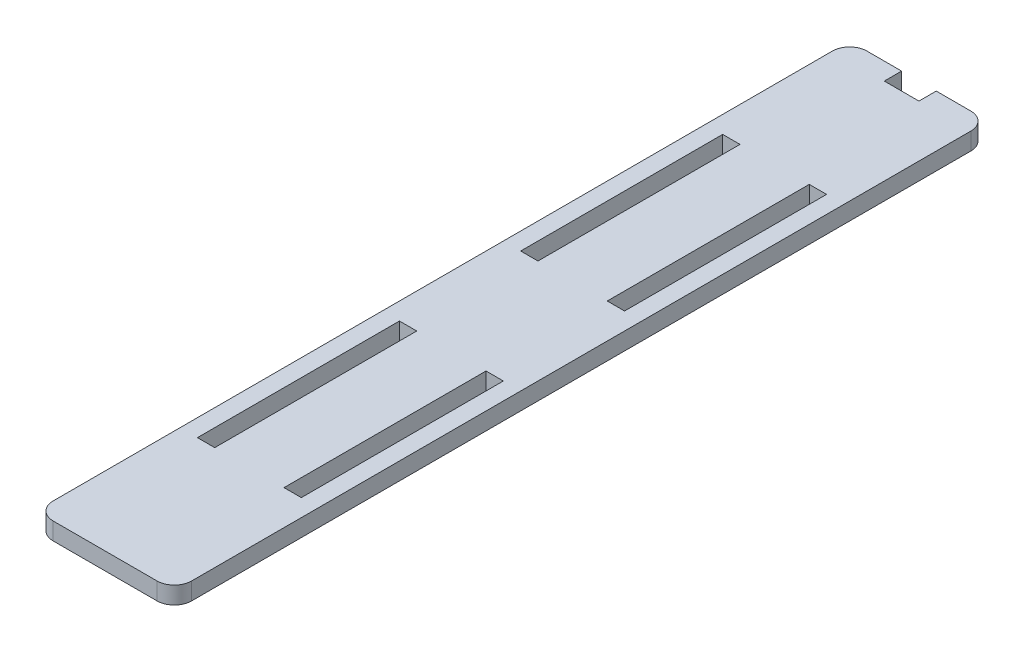
ISO-10303-21;
HEADER;
FILE_DESCRIPTION(('STEP AP214'),'2;1');
FILE_NAME('part.step','',(''),(''),'','','');
FILE_SCHEMA(('AUTOMOTIVE_DESIGN { 1 0 10303 214 1 1 1 1 }'));
ENDSEC;
DATA;
#1=APPLICATION_CONTEXT('core data for automotive mechanical design processes');
#2=APPLICATION_PROTOCOL_DEFINITION('international standard','automotive_design',2000,#1);
#3=PRODUCT_CONTEXT('',#1,'mechanical');
#4=PRODUCT('Part','Part','',(#3));
#5=PRODUCT_RELATED_PRODUCT_CATEGORY('part','',(#4));
#6=PRODUCT_DEFINITION_FORMATION('','',#4);
#7=PRODUCT_DEFINITION_CONTEXT('part definition',#1,'design');
#8=PRODUCT_DEFINITION('design','',#6,#7);
#9=PRODUCT_DEFINITION_SHAPE('','',#8);
#10=(LENGTH_UNIT() NAMED_UNIT(*) SI_UNIT(.MILLI.,.METRE.));
#11=(NAMED_UNIT(*) PLANE_ANGLE_UNIT() SI_UNIT($,.RADIAN.));
#12=(NAMED_UNIT(*) SI_UNIT($,.STERADIAN.) SOLID_ANGLE_UNIT());
#13=UNCERTAINTY_MEASURE_WITH_UNIT(LENGTH_MEASURE(1.E-05),#10,'distance_accuracy_value','');
#14=(GEOMETRIC_REPRESENTATION_CONTEXT(3) GLOBAL_UNCERTAINTY_ASSIGNED_CONTEXT((#13)) GLOBAL_UNIT_ASSIGNED_CONTEXT((#10,
#11,#12)) REPRESENTATION_CONTEXT('',''));
#15=CARTESIAN_POINT('',(0.,0.,0.));
#16=DIRECTION('',(0.,0.,1.));
#17=DIRECTION('',(1.,0.,0.));
#18=AXIS2_PLACEMENT_3D('',#15,#16,#17);
#19=CARTESIAN_POINT('',(-12.,1.5,-70.5));
#20=DIRECTION('',(0.,0.,1.));
#21=DIRECTION('',(1.,0.,0.));
#22=AXIS2_PLACEMENT_3D('',#19,#20,#21);
#23=PLANE('',#22);
#24=DIRECTION('',(-1.,0.,0.));
#25=VECTOR('',#24,1.);
#26=CARTESIAN_POINT('',(-12.,1.5,-70.5));
#27=LINE('',#26,#25);
#28=CARTESIAN_POINT('',(-3.,1.5,-70.5));
#29=VERTEX_POINT('',#28);
#30=CARTESIAN_POINT('',(-9.,1.5,-70.5));
#31=VERTEX_POINT('',#30);
#32=EDGE_CURVE('E58',#29,#31,#27,.T.);
#33=ORIENTED_EDGE('',*,*,#32,.F.);
#34=DIRECTION('',(0.,1.,0.));
#35=VECTOR('',#34,1.);
#36=CARTESIAN_POINT('',(-3.,-1.5,-70.5));
#37=LINE('',#36,#35);
#38=CARTESIAN_POINT('',(-3.,-1.5,-70.5));
#39=VERTEX_POINT('',#38);
#40=EDGE_CURVE('E236',#39,#29,#37,.T.);
#41=ORIENTED_EDGE('',*,*,#40,.F.);
#42=DIRECTION('',(-1.,0.,0.));
#43=VECTOR('',#42,1.);
#44=CARTESIAN_POINT('',(-12.,-1.5,-70.5));
#45=LINE('',#44,#43);
#46=CARTESIAN_POINT('',(-9.,-1.5,-70.5));
#47=VERTEX_POINT('',#46);
#48=EDGE_CURVE('E404',#39,#47,#45,.T.);
#49=ORIENTED_EDGE('',*,*,#48,.T.);
#50=DIRECTION('',(0.,-1.,0.));
#51=VECTOR('',#50,1.);
#52=CARTESIAN_POINT('',(-9.,1.5,-70.5));
#53=LINE('',#52,#51);
#54=EDGE_CURVE('E43',#47,#31,#53,.F.);
#55=ORIENTED_EDGE('',*,*,#54,.T.);
#56=EDGE_LOOP('',(#33,#41,#49,#55));
#57=FACE_BOUND('',#56,.T.);
#58=ADVANCED_FACE('F35',(#57),#23,.F.);
#59=CARTESIAN_POINT('',(-12.,1.5,-70.5));
#60=DIRECTION('',(1.,0.,0.));
#61=DIRECTION('',(0.,0.,-1.));
#62=AXIS2_PLACEMENT_3D('',#59,#60,#61);
#63=PLANE('',#62);
#64=DIRECTION('',(0.,0.,1.));
#65=VECTOR('',#64,1.);
#66=CARTESIAN_POINT('',(-12.,-1.5,-70.5));
#67=LINE('',#66,#65);
#68=CARTESIAN_POINT('',(-12.,-1.5,-67.5));
#69=VERTEX_POINT('',#68);
#70=CARTESIAN_POINT('',(-12.,-1.5,67.5));
#71=VERTEX_POINT('',#70);
#72=EDGE_CURVE('E376',#69,#71,#67,.T.);
#73=ORIENTED_EDGE('',*,*,#72,.T.);
#74=DIRECTION('',(0.,-1.,0.));
#75=VECTOR('',#74,1.);
#76=CARTESIAN_POINT('',(-12.,1.5,67.5));
#77=LINE('',#76,#75);
#78=CARTESIAN_POINT('',(-12.,1.5,67.5));
#79=VERTEX_POINT('',#78);
#80=EDGE_CURVE('E436',#71,#79,#77,.F.);
#81=ORIENTED_EDGE('',*,*,#80,.T.);
#82=DIRECTION('',(0.,0.,1.));
#83=VECTOR('',#82,1.);
#84=CARTESIAN_POINT('',(-12.,1.5,-70.5));
#85=LINE('',#84,#83);
#86=CARTESIAN_POINT('',(-12.,1.5,-67.5));
#87=VERTEX_POINT('',#86);
#88=EDGE_CURVE('E383',#87,#79,#85,.T.);
#89=ORIENTED_EDGE('',*,*,#88,.F.);
#90=DIRECTION('',(0.,-1.,0.));
#91=VECTOR('',#90,1.);
#92=CARTESIAN_POINT('',(-12.,1.5,-67.5));
#93=LINE('',#92,#91);
#94=EDGE_CURVE('E433',#87,#69,#93,.T.);
#95=ORIENTED_EDGE('',*,*,#94,.T.);
#96=EDGE_LOOP('',(#73,#81,#89,#95));
#97=FACE_BOUND('',#96,.T.);
#98=ADVANCED_FACE('F446',(#97),#63,.F.);
#99=CARTESIAN_POINT('',(-12.,1.5,70.5));
#100=DIRECTION('',(0.,0.,-1.));
#101=DIRECTION('',(-1.,0.,0.));
#102=AXIS2_PLACEMENT_3D('',#99,#100,#101);
#103=PLANE('',#102);
#104=DIRECTION('',(1.,0.,0.));
#105=VECTOR('',#104,1.);
#106=CARTESIAN_POINT('',(-12.,-1.5,70.5));
#107=LINE('',#106,#105);
#108=CARTESIAN_POINT('',(-8.99999999999999,-1.5,70.5));
#109=VERTEX_POINT('',#108);
#110=CARTESIAN_POINT('',(9.,-1.5,70.5));
#111=VERTEX_POINT('',#110);
#112=EDGE_CURVE('E398',#109,#111,#107,.T.);
#113=ORIENTED_EDGE('',*,*,#112,.T.);
#114=DIRECTION('',(0.,-1.,0.));
#115=VECTOR('',#114,1.);
#116=CARTESIAN_POINT('',(9.,1.5,70.5));
#117=LINE('',#116,#115);
#118=CARTESIAN_POINT('',(9.,1.5,70.5));
#119=VERTEX_POINT('',#118);
#120=EDGE_CURVE('E423',#111,#119,#117,.F.);
#121=ORIENTED_EDGE('',*,*,#120,.T.);
#122=DIRECTION('',(1.,0.,0.));
#123=VECTOR('',#122,1.);
#124=CARTESIAN_POINT('',(-12.,1.5,70.5));
#125=LINE('',#124,#123);
#126=CARTESIAN_POINT('',(-8.99999999999999,1.5,70.5));
#127=VERTEX_POINT('',#126);
#128=EDGE_CURVE('E386',#127,#119,#125,.T.);
#129=ORIENTED_EDGE('',*,*,#128,.F.);
#130=DIRECTION('',(0.,-1.,0.));
#131=VECTOR('',#130,1.);
#132=CARTESIAN_POINT('',(-8.99999999999999,1.5,70.5));
#133=LINE('',#132,#131);
#134=EDGE_CURVE('E420',#127,#109,#133,.T.);
#135=ORIENTED_EDGE('',*,*,#134,.T.);
#136=EDGE_LOOP('',(#113,#121,#129,#135));
#137=FACE_BOUND('',#136,.T.);
#138=ADVANCED_FACE('F455',(#137),#103,.F.);
#139=CARTESIAN_POINT('',(12.,1.5,-70.5));
#140=DIRECTION('',(-1.,0.,0.));
#141=DIRECTION('',(0.,0.,1.));
#142=AXIS2_PLACEMENT_3D('',#139,#140,#141);
#143=PLANE('',#142);
#144=DIRECTION('',(0.,0.,-1.));
#145=VECTOR('',#144,1.);
#146=CARTESIAN_POINT('',(12.,1.5,-70.5));
#147=LINE('',#146,#145);
#148=CARTESIAN_POINT('',(12.,1.5,67.5));
#149=VERTEX_POINT('',#148);
#150=CARTESIAN_POINT('',(12.,1.5,-67.5));
#151=VERTEX_POINT('',#150);
#152=EDGE_CURVE('E390',#149,#151,#147,.T.);
#153=ORIENTED_EDGE('',*,*,#152,.F.);
#154=DIRECTION('',(0.,-1.,0.));
#155=VECTOR('',#154,1.);
#156=CARTESIAN_POINT('',(12.,1.5,67.5));
#157=LINE('',#156,#155);
#158=CARTESIAN_POINT('',(12.,-1.5,67.5));
#159=VERTEX_POINT('',#158);
#160=EDGE_CURVE('E408',#149,#159,#157,.T.);
#161=ORIENTED_EDGE('',*,*,#160,.T.);
#162=DIRECTION('',(0.,0.,-1.));
#163=VECTOR('',#162,1.);
#164=CARTESIAN_POINT('',(12.,-1.5,-70.5));
#165=LINE('',#164,#163);
#166=CARTESIAN_POINT('',(12.,-1.5,-67.5));
#167=VERTEX_POINT('',#166);
#168=EDGE_CURVE('E401',#159,#167,#165,.T.);
#169=ORIENTED_EDGE('',*,*,#168,.T.);
#170=DIRECTION('',(0.,-1.,0.));
#171=VECTOR('',#170,1.);
#172=CARTESIAN_POINT('',(12.,1.5,-67.5));
#173=LINE('',#172,#171);
#174=EDGE_CURVE('E395',#167,#151,#173,.F.);
#175=ORIENTED_EDGE('',*,*,#174,.T.);
#176=EDGE_LOOP('',(#153,#161,#169,#175));
#177=FACE_BOUND('',#176,.T.);
#178=ADVANCED_FACE('F464',(#177),#143,.F.);
#179=CARTESIAN_POINT('',(9.00000000000001,-1.5,-70.5));
#180=VERTEX_POINT('',#179);
#181=CARTESIAN_POINT('',(3.,-1.5,-70.5));
#182=VERTEX_POINT('',#181);
#183=EDGE_CURVE('E387',#180,#182,#45,.T.);
#184=ORIENTED_EDGE('',*,*,#183,.T.);
#185=DIRECTION('',(0.,1.,0.));
#186=VECTOR('',#185,1.);
#187=CARTESIAN_POINT('',(3.,-1.5,-70.5));
#188=LINE('',#187,#186);
#189=CARTESIAN_POINT('',(3.,1.5,-70.5));
#190=VERTEX_POINT('',#189);
#191=EDGE_CURVE('E251',#182,#190,#188,.T.);
#192=ORIENTED_EDGE('',*,*,#191,.T.);
#193=CARTESIAN_POINT('',(9.00000000000001,1.5,-70.5));
#194=VERTEX_POINT('',#193);
#195=EDGE_CURVE('E393',#194,#190,#27,.T.);
#196=ORIENTED_EDGE('',*,*,#195,.F.);
#197=DIRECTION('',(0.,-1.,0.));
#198=VECTOR('',#197,1.);
#199=CARTESIAN_POINT('',(9.00000000000001,1.5,-70.5));
#200=LINE('',#199,#198);
#201=EDGE_CURVE('E11',#194,#180,#200,.T.);
#202=ORIENTED_EDGE('',*,*,#201,.T.);
#203=EDGE_LOOP('',(#184,#192,#196,#202));
#204=FACE_BOUND('',#203,.T.);
#205=ADVANCED_FACE('F472',(#204),#23,.F.);
#206=CARTESIAN_POINT('',(0.,1.5,0.));
#207=DIRECTION('',(0.,1.,0.));
#208=DIRECTION('',(0.,0.,1.));
#209=AXIS2_PLACEMENT_3D('',#206,#207,#208);
#210=PLANE('',#209);
#211=DIRECTION('',(0.,0.,1.));
#212=VECTOR('',#211,1.);
#213=CARTESIAN_POINT('',(-3.,1.5,-70.5));
#214=LINE('',#213,#212);
#215=CARTESIAN_POINT('',(-3.,1.5,-67.5));
#216=VERTEX_POINT('',#215);
#217=EDGE_CURVE('E233',#29,#216,#214,.T.);
#218=ORIENTED_EDGE('',*,*,#217,.F.);
#219=ORIENTED_EDGE('',*,*,#32,.T.);
#220=CARTESIAN_POINT('',(-9.,1.5,-67.5));
#221=DIRECTION('',(0.,1.,0.));
#222=DIRECTION('',(0.,0.,1.));
#223=AXIS2_PLACEMENT_3D('',#220,#221,#222);
#224=CIRCLE('',#223,3.);
#225=EDGE_CURVE('E425',#31,#87,#224,.T.);
#226=ORIENTED_EDGE('',*,*,#225,.T.);
#227=ORIENTED_EDGE('',*,*,#88,.T.);
#228=CARTESIAN_POINT('',(-8.99999999999999,1.5,67.5));
#229=DIRECTION('',(0.,1.,0.));
#230=DIRECTION('',(0.,0.,1.));
#231=AXIS2_PLACEMENT_3D('',#228,#229,#230);
#232=CIRCLE('',#231,3.);
#233=EDGE_CURVE('E429',#79,#127,#232,.T.);
#234=ORIENTED_EDGE('',*,*,#233,.T.);
#235=ORIENTED_EDGE('',*,*,#128,.T.);
#236=CARTESIAN_POINT('',(9.00000000000001,1.5,67.5));
#237=DIRECTION('',(0.,1.,0.));
#238=DIRECTION('',(0.,0.,1.));
#239=AXIS2_PLACEMENT_3D('',#236,#237,#238);
#240=CIRCLE('',#239,3.);
#241=EDGE_CURVE('E431',#119,#149,#240,.T.);
#242=ORIENTED_EDGE('',*,*,#241,.T.);
#243=ORIENTED_EDGE('',*,*,#152,.T.);
#244=CARTESIAN_POINT('',(9.00000000000001,1.5,-67.5));
#245=DIRECTION('',(0.,1.,0.));
#246=DIRECTION('',(0.,0.,1.));
#247=AXIS2_PLACEMENT_3D('',#244,#245,#246);
#248=CIRCLE('',#247,3.);
#249=EDGE_CURVE('E427',#151,#194,#248,.T.);
#250=ORIENTED_EDGE('',*,*,#249,.T.);
#251=ORIENTED_EDGE('',*,*,#195,.T.);
#252=DIRECTION('',(0.,0.,-1.));
#253=VECTOR('',#252,1.);
#254=CARTESIAN_POINT('',(3.,1.5,-70.5));
#255=LINE('',#254,#253);
#256=CARTESIAN_POINT('',(3.,1.5,-67.5));
#257=VERTEX_POINT('',#256);
#258=EDGE_CURVE('E241',#257,#190,#255,.T.);
#259=ORIENTED_EDGE('',*,*,#258,.F.);
#260=DIRECTION('',(1.,0.,0.));
#261=VECTOR('',#260,1.);
#262=CARTESIAN_POINT('',(-3.,1.5,-67.5));
#263=LINE('',#262,#261);
#264=EDGE_CURVE('E225',#216,#257,#263,.T.);
#265=ORIENTED_EDGE('',*,*,#264,.F.);
#266=EDGE_LOOP('',(#218,#219,#226,#227,#234,#235,#242,#243,#250,#251,#259,#265));
#267=FACE_BOUND('',#266,.T.);
#268=DIRECTION('',(-1.,0.,0.));
#269=VECTOR('',#268,1.);
#270=CARTESIAN_POINT('',(9.,1.5,-45.5));
#271=LINE('',#270,#269);
#272=CARTESIAN_POINT('',(9.,1.5,-45.5));
#273=VERTEX_POINT('',#272);
#274=CARTESIAN_POINT('',(6.,1.5,-45.5));
#275=VERTEX_POINT('',#274);
#276=EDGE_CURVE('E287',#273,#275,#271,.T.);
#277=ORIENTED_EDGE('',*,*,#276,.F.);
#278=DIRECTION('',(0.,0.,-1.));
#279=VECTOR('',#278,1.);
#280=CARTESIAN_POINT('',(9.,1.5,-45.5));
#281=LINE('',#280,#279);
#282=CARTESIAN_POINT('',(9.,1.5,-10.5));
#283=VERTEX_POINT('',#282);
#284=EDGE_CURVE('E296',#283,#273,#281,.T.);
#285=ORIENTED_EDGE('',*,*,#284,.F.);
#286=DIRECTION('',(1.,0.,0.));
#287=VECTOR('',#286,1.);
#288=CARTESIAN_POINT('',(9.,1.5,-10.5));
#289=LINE('',#288,#287);
#290=CARTESIAN_POINT('',(5.99999999999999,1.5,-10.5));
#291=VERTEX_POINT('',#290);
#292=EDGE_CURVE('E293',#291,#283,#289,.T.);
#293=ORIENTED_EDGE('',*,*,#292,.F.);
#294=DIRECTION('',(0.,0.,1.));
#295=VECTOR('',#294,1.);
#296=CARTESIAN_POINT('',(6.,1.5,-45.5));
#297=LINE('',#296,#295);
#298=EDGE_CURVE('E289',#275,#291,#297,.T.);
#299=ORIENTED_EDGE('',*,*,#298,.F.);
#300=EDGE_LOOP('',(#277,#285,#293,#299));
#301=FACE_BOUND('',#300,.T.);
#302=DIRECTION('',(0.,0.,1.));
#303=VECTOR('',#302,1.);
#304=CARTESIAN_POINT('',(-8.99999999999999,1.5,10.5));
#305=LINE('',#304,#303);
#306=CARTESIAN_POINT('',(-8.99999999999999,1.5,10.5));
#307=VERTEX_POINT('',#306);
#308=CARTESIAN_POINT('',(-8.99999999999999,1.5,45.5));
#309=VERTEX_POINT('',#308);
#310=EDGE_CURVE('E280',#307,#309,#305,.T.);
#311=ORIENTED_EDGE('',*,*,#310,.F.);
#312=DIRECTION('',(-1.,0.,0.));
#313=VECTOR('',#312,1.);
#314=CARTESIAN_POINT('',(-8.99999999999999,1.5,10.5));
#315=LINE('',#314,#313);
#316=CARTESIAN_POINT('',(-5.99999999999999,1.5,10.5));
#317=VERTEX_POINT('',#316);
#318=EDGE_CURVE('E328',#317,#307,#315,.T.);
#319=ORIENTED_EDGE('',*,*,#318,.F.);
#320=DIRECTION('',(0.,0.,-1.));
#321=VECTOR('',#320,1.);
#322=CARTESIAN_POINT('',(-5.99999999999999,1.5,10.5));
#323=LINE('',#322,#321);
#324=CARTESIAN_POINT('',(-5.99999999999999,1.5,45.5));
#325=VERTEX_POINT('',#324);
#326=EDGE_CURVE('E325',#325,#317,#323,.T.);
#327=ORIENTED_EDGE('',*,*,#326,.F.);
#328=DIRECTION('',(1.,0.,0.));
#329=VECTOR('',#328,1.);
#330=CARTESIAN_POINT('',(-8.99999999999999,1.5,45.5));
#331=LINE('',#330,#329);
#332=EDGE_CURVE('E322',#309,#325,#331,.T.);
#333=ORIENTED_EDGE('',*,*,#332,.F.);
#334=EDGE_LOOP('',(#311,#319,#327,#333));
#335=FACE_BOUND('',#334,.T.);
#336=DIRECTION('',(-1.,0.,0.));
#337=VECTOR('',#336,1.);
#338=CARTESIAN_POINT('',(8.99999999999999,1.5,10.5));
#339=LINE('',#338,#337);
#340=CARTESIAN_POINT('',(8.99999999999999,1.5,10.5));
#341=VERTEX_POINT('',#340);
#342=CARTESIAN_POINT('',(5.99999999999999,1.5,10.5));
#343=VERTEX_POINT('',#342);
#344=EDGE_CURVE('E250',#341,#343,#339,.T.);
#345=ORIENTED_EDGE('',*,*,#344,.F.);
#346=DIRECTION('',(0.,0.,-1.));
#347=VECTOR('',#346,1.);
#348=CARTESIAN_POINT('',(8.99999999999999,1.5,10.5));
#349=LINE('',#348,#347);
#350=CARTESIAN_POINT('',(8.99999999999999,1.5,45.5));
#351=VERTEX_POINT('',#350);
#352=EDGE_CURVE('E262',#351,#341,#349,.T.);
#353=ORIENTED_EDGE('',*,*,#352,.F.);
#354=DIRECTION('',(1.,0.,0.));
#355=VECTOR('',#354,1.);
#356=CARTESIAN_POINT('',(8.99999999999999,1.5,45.5));
#357=LINE('',#356,#355);
#358=CARTESIAN_POINT('',(5.99999999999999,1.5,45.5));
#359=VERTEX_POINT('',#358);
#360=EDGE_CURVE('E259',#359,#351,#357,.T.);
#361=ORIENTED_EDGE('',*,*,#360,.F.);
#362=DIRECTION('',(0.,0.,1.));
#363=VECTOR('',#362,1.);
#364=CARTESIAN_POINT('',(5.99999999999999,1.5,10.5));
#365=LINE('',#364,#363);
#366=EDGE_CURVE('E256',#343,#359,#365,.T.);
#367=ORIENTED_EDGE('',*,*,#366,.F.);
#368=EDGE_LOOP('',(#345,#353,#361,#367));
#369=FACE_BOUND('',#368,.T.);
#370=DIRECTION('',(0.,0.,1.));
#371=VECTOR('',#370,1.);
#372=CARTESIAN_POINT('',(-9.,1.5,-45.5));
#373=LINE('',#372,#371);
#374=CARTESIAN_POINT('',(-9.,1.5,-45.5));
#375=VERTEX_POINT('',#374);
#376=CARTESIAN_POINT('',(-9.,1.5,-10.5));
#377=VERTEX_POINT('',#376);
#378=EDGE_CURVE('E314',#375,#377,#373,.T.);
#379=ORIENTED_EDGE('',*,*,#378,.F.);
#380=DIRECTION('',(-1.,0.,0.));
#381=VECTOR('',#380,1.);
#382=CARTESIAN_POINT('',(-9.,1.5,-45.5));
#383=LINE('',#382,#381);
#384=CARTESIAN_POINT('',(-6.,1.5,-45.5));
#385=VERTEX_POINT('',#384);
#386=EDGE_CURVE('E358',#385,#375,#383,.T.);
#387=ORIENTED_EDGE('',*,*,#386,.F.);
#388=DIRECTION('',(0.,0.,-1.));
#389=VECTOR('',#388,1.);
#390=CARTESIAN_POINT('',(-6.,1.5,-45.5));
#391=LINE('',#390,#389);
#392=CARTESIAN_POINT('',(-5.99999999999999,1.5,-10.5));
#393=VERTEX_POINT('',#392);
#394=EDGE_CURVE('E355',#393,#385,#391,.T.);
#395=ORIENTED_EDGE('',*,*,#394,.F.);
#396=DIRECTION('',(1.,0.,0.));
#397=VECTOR('',#396,1.);
#398=CARTESIAN_POINT('',(-9.,1.5,-10.5));
#399=LINE('',#398,#397);
#400=EDGE_CURVE('E352',#377,#393,#399,.T.);
#401=ORIENTED_EDGE('',*,*,#400,.F.);
#402=EDGE_LOOP('',(#379,#387,#395,#401));
#403=FACE_BOUND('',#402,.T.);
#404=ADVANCED_FACE('F238',(#267,#301,#335,#369,#403),#210,.T.);
#405=CARTESIAN_POINT('',(0.,-1.5,0.));
#406=DIRECTION('',(0.,1.,0.));
#407=DIRECTION('',(0.,0.,1.));
#408=AXIS2_PLACEMENT_3D('',#405,#406,#407);
#409=PLANE('',#408);
#410=ORIENTED_EDGE('',*,*,#48,.F.);
#411=DIRECTION('',(0.,0.,1.));
#412=VECTOR('',#411,1.);
#413=CARTESIAN_POINT('',(-3.,-1.5,-70.5));
#414=LINE('',#413,#412);
#415=CARTESIAN_POINT('',(-3.,-1.5,-67.5));
#416=VERTEX_POINT('',#415);
#417=EDGE_CURVE('E243',#39,#416,#414,.T.);
#418=ORIENTED_EDGE('',*,*,#417,.T.);
#419=DIRECTION('',(1.,0.,0.));
#420=VECTOR('',#419,1.);
#421=CARTESIAN_POINT('',(-3.,-1.5,-67.5));
#422=LINE('',#421,#420);
#423=CARTESIAN_POINT('',(3.,-1.5,-67.5));
#424=VERTEX_POINT('',#423);
#425=EDGE_CURVE('E228',#416,#424,#422,.T.);
#426=ORIENTED_EDGE('',*,*,#425,.T.);
#427=DIRECTION('',(0.,0.,-1.));
#428=VECTOR('',#427,1.);
#429=CARTESIAN_POINT('',(3.,-1.5,-70.5));
#430=LINE('',#429,#428);
#431=EDGE_CURVE('E50',#424,#182,#430,.T.);
#432=ORIENTED_EDGE('',*,*,#431,.T.);
#433=ORIENTED_EDGE('',*,*,#183,.F.);
#434=CARTESIAN_POINT('',(9.00000000000001,-1.5,-67.5));
#435=DIRECTION('',(0.,1.,0.));
#436=DIRECTION('',(0.,0.,1.));
#437=AXIS2_PLACEMENT_3D('',#434,#435,#436);
#438=CIRCLE('',#437,3.);
#439=EDGE_CURVE('E414',#180,#167,#438,.F.);
#440=ORIENTED_EDGE('',*,*,#439,.T.);
#441=ORIENTED_EDGE('',*,*,#168,.F.);
#442=CARTESIAN_POINT('',(9.00000000000001,-1.5,67.5));
#443=DIRECTION('',(0.,1.,0.));
#444=DIRECTION('',(0.,0.,1.));
#445=AXIS2_PLACEMENT_3D('',#442,#443,#444);
#446=CIRCLE('',#445,3.);
#447=EDGE_CURVE('E418',#159,#111,#446,.F.);
#448=ORIENTED_EDGE('',*,*,#447,.T.);
#449=ORIENTED_EDGE('',*,*,#112,.F.);
#450=CARTESIAN_POINT('',(-8.99999999999999,-1.5,67.5));
#451=DIRECTION('',(0.,1.,0.));
#452=DIRECTION('',(0.,0.,1.));
#453=AXIS2_PLACEMENT_3D('',#450,#451,#452);
#454=CIRCLE('',#453,3.);
#455=EDGE_CURVE('E416',#109,#71,#454,.F.);
#456=ORIENTED_EDGE('',*,*,#455,.T.);
#457=ORIENTED_EDGE('',*,*,#72,.F.);
#458=CARTESIAN_POINT('',(-9.,-1.5,-67.5));
#459=DIRECTION('',(0.,1.,0.));
#460=DIRECTION('',(0.,0.,1.));
#461=AXIS2_PLACEMENT_3D('',#458,#459,#460);
#462=CIRCLE('',#461,3.);
#463=EDGE_CURVE('E411',#69,#47,#462,.F.);
#464=ORIENTED_EDGE('',*,*,#463,.T.);
#465=EDGE_LOOP('',(#410,#418,#426,#432,#433,#440,#441,#448,#449,#456,#457,#464));
#466=FACE_BOUND('',#465,.T.);
#467=DIRECTION('',(0.,0.,-1.));
#468=VECTOR('',#467,1.);
#469=CARTESIAN_POINT('',(9.,-1.5,-45.5));
#470=LINE('',#469,#468);
#471=CARTESIAN_POINT('',(9.,-1.5,-10.5));
#472=VERTEX_POINT('',#471);
#473=CARTESIAN_POINT('',(9.,-1.5,-45.5));
#474=VERTEX_POINT('',#473);
#475=EDGE_CURVE('E308',#472,#474,#470,.T.);
#476=ORIENTED_EDGE('',*,*,#475,.T.);
#477=DIRECTION('',(-1.,0.,0.));
#478=VECTOR('',#477,1.);
#479=CARTESIAN_POINT('',(9.,-1.5,-45.5));
#480=LINE('',#479,#478);
#481=CARTESIAN_POINT('',(6.,-1.5,-45.5));
#482=VERTEX_POINT('',#481);
#483=EDGE_CURVE('E299',#474,#482,#480,.T.);
#484=ORIENTED_EDGE('',*,*,#483,.T.);
#485=DIRECTION('',(0.,0.,1.));
#486=VECTOR('',#485,1.);
#487=CARTESIAN_POINT('',(6.,-1.5,-45.5));
#488=LINE('',#487,#486);
#489=CARTESIAN_POINT('',(5.99999999999999,-1.5,-10.5));
#490=VERTEX_POINT('',#489);
#491=EDGE_CURVE('E302',#482,#490,#488,.T.);
#492=ORIENTED_EDGE('',*,*,#491,.T.);
#493=DIRECTION('',(1.,0.,0.));
#494=VECTOR('',#493,1.);
#495=CARTESIAN_POINT('',(9.,-1.5,-10.5));
#496=LINE('',#495,#494);
#497=EDGE_CURVE('E305',#490,#472,#496,.T.);
#498=ORIENTED_EDGE('',*,*,#497,.T.);
#499=EDGE_LOOP('',(#476,#484,#492,#498));
#500=FACE_BOUND('',#499,.T.);
#501=DIRECTION('',(-1.,0.,0.));
#502=VECTOR('',#501,1.);
#503=CARTESIAN_POINT('',(-8.99999999999999,-1.5,10.5));
#504=LINE('',#503,#502);
#505=CARTESIAN_POINT('',(-5.99999999999999,-1.5,10.5));
#506=VERTEX_POINT('',#505);
#507=CARTESIAN_POINT('',(-8.99999999999999,-1.5,10.5));
#508=VERTEX_POINT('',#507);
#509=EDGE_CURVE('E340',#506,#508,#504,.T.);
#510=ORIENTED_EDGE('',*,*,#509,.T.);
#511=DIRECTION('',(0.,0.,1.));
#512=VECTOR('',#511,1.);
#513=CARTESIAN_POINT('',(-8.99999999999999,-1.5,10.5));
#514=LINE('',#513,#512);
#515=CARTESIAN_POINT('',(-8.99999999999999,-1.5,45.5));
#516=VERTEX_POINT('',#515);
#517=EDGE_CURVE('E331',#508,#516,#514,.T.);
#518=ORIENTED_EDGE('',*,*,#517,.T.);
#519=DIRECTION('',(1.,0.,0.));
#520=VECTOR('',#519,1.);
#521=CARTESIAN_POINT('',(-8.99999999999999,-1.5,45.5));
#522=LINE('',#521,#520);
#523=CARTESIAN_POINT('',(-5.99999999999999,-1.5,45.5));
#524=VERTEX_POINT('',#523);
#525=EDGE_CURVE('E334',#516,#524,#522,.T.);
#526=ORIENTED_EDGE('',*,*,#525,.T.);
#527=DIRECTION('',(0.,0.,-1.));
#528=VECTOR('',#527,1.);
#529=CARTESIAN_POINT('',(-5.99999999999999,-1.5,10.5));
#530=LINE('',#529,#528);
#531=EDGE_CURVE('E337',#524,#506,#530,.T.);
#532=ORIENTED_EDGE('',*,*,#531,.T.);
#533=EDGE_LOOP('',(#510,#518,#526,#532));
#534=FACE_BOUND('',#533,.T.);
#535=DIRECTION('',(0.,0.,-1.));
#536=VECTOR('',#535,1.);
#537=CARTESIAN_POINT('',(8.99999999999999,-1.5,10.5));
#538=LINE('',#537,#536);
#539=CARTESIAN_POINT('',(8.99999999999999,-1.5,45.5));
#540=VERTEX_POINT('',#539);
#541=CARTESIAN_POINT('',(8.99999999999999,-1.5,10.5));
#542=VERTEX_POINT('',#541);
#543=EDGE_CURVE('E274',#540,#542,#538,.T.);
#544=ORIENTED_EDGE('',*,*,#543,.T.);
#545=DIRECTION('',(-1.,0.,0.));
#546=VECTOR('',#545,1.);
#547=CARTESIAN_POINT('',(8.99999999999999,-1.5,10.5));
#548=LINE('',#547,#546);
#549=CARTESIAN_POINT('',(5.99999999999999,-1.5,10.5));
#550=VERTEX_POINT('',#549);
#551=EDGE_CURVE('E265',#542,#550,#548,.T.);
#552=ORIENTED_EDGE('',*,*,#551,.T.);
#553=DIRECTION('',(0.,0.,1.));
#554=VECTOR('',#553,1.);
#555=CARTESIAN_POINT('',(5.99999999999999,-1.5,10.5));
#556=LINE('',#555,#554);
#557=CARTESIAN_POINT('',(5.99999999999999,-1.5,45.5));
#558=VERTEX_POINT('',#557);
#559=EDGE_CURVE('E268',#550,#558,#556,.T.);
#560=ORIENTED_EDGE('',*,*,#559,.T.);
#561=DIRECTION('',(1.,0.,0.));
#562=VECTOR('',#561,1.);
#563=CARTESIAN_POINT('',(8.99999999999999,-1.5,45.5));
#564=LINE('',#563,#562);
#565=EDGE_CURVE('E271',#558,#540,#564,.T.);
#566=ORIENTED_EDGE('',*,*,#565,.T.);
#567=EDGE_LOOP('',(#544,#552,#560,#566));
#568=FACE_BOUND('',#567,.T.);
#569=DIRECTION('',(-1.,0.,0.));
#570=VECTOR('',#569,1.);
#571=CARTESIAN_POINT('',(-9.,-1.5,-45.5));
#572=LINE('',#571,#570);
#573=CARTESIAN_POINT('',(-6.,-1.5,-45.5));
#574=VERTEX_POINT('',#573);
#575=CARTESIAN_POINT('',(-9.,-1.5,-45.5));
#576=VERTEX_POINT('',#575);
#577=EDGE_CURVE('E370',#574,#576,#572,.T.);
#578=ORIENTED_EDGE('',*,*,#577,.T.);
#579=DIRECTION('',(0.,0.,1.));
#580=VECTOR('',#579,1.);
#581=CARTESIAN_POINT('',(-9.,-1.5,-45.5));
#582=LINE('',#581,#580);
#583=CARTESIAN_POINT('',(-9.,-1.5,-10.5));
#584=VERTEX_POINT('',#583);
#585=EDGE_CURVE('E361',#576,#584,#582,.T.);
#586=ORIENTED_EDGE('',*,*,#585,.T.);
#587=DIRECTION('',(1.,0.,0.));
#588=VECTOR('',#587,1.);
#589=CARTESIAN_POINT('',(-9.,-1.5,-10.5));
#590=LINE('',#589,#588);
#591=CARTESIAN_POINT('',(-5.99999999999999,-1.5,-10.5));
#592=VERTEX_POINT('',#591);
#593=EDGE_CURVE('E364',#584,#592,#590,.T.);
#594=ORIENTED_EDGE('',*,*,#593,.T.);
#595=DIRECTION('',(0.,0.,-1.));
#596=VECTOR('',#595,1.);
#597=CARTESIAN_POINT('',(-6.,-1.5,-45.5));
#598=LINE('',#597,#596);
#599=EDGE_CURVE('E367',#592,#574,#598,.T.);
#600=ORIENTED_EDGE('',*,*,#599,.T.);
#601=EDGE_LOOP('',(#578,#586,#594,#600));
#602=FACE_BOUND('',#601,.T.);
#603=ADVANCED_FACE('F476',(#466,#500,#534,#568,#602),#409,.F.);
#604=CARTESIAN_POINT('',(-9.,-1.5,-45.5));
#605=DIRECTION('',(-1.,0.,0.));
#606=DIRECTION('',(0.,0.,1.));
#607=AXIS2_PLACEMENT_3D('',#604,#605,#606);
#608=PLANE('',#607);
#609=DIRECTION('',(0.,1.,0.));
#610=VECTOR('',#609,1.);
#611=CARTESIAN_POINT('',(-9.,-1.5,-10.5));
#612=LINE('',#611,#610);
#613=EDGE_CURVE('E373',#584,#377,#612,.T.);
#614=ORIENTED_EDGE('',*,*,#613,.F.);
#615=ORIENTED_EDGE('',*,*,#585,.F.);
#616=DIRECTION('',(0.,1.,0.));
#617=VECTOR('',#616,1.);
#618=CARTESIAN_POINT('',(-9.,-1.5,-45.5));
#619=LINE('',#618,#617);
#620=EDGE_CURVE('E374',#576,#375,#619,.T.);
#621=ORIENTED_EDGE('',*,*,#620,.T.);
#622=ORIENTED_EDGE('',*,*,#378,.T.);
#623=EDGE_LOOP('',(#614,#615,#621,#622));
#624=FACE_BOUND('',#623,.T.);
#625=ADVANCED_FACE('F479',(#624),#608,.F.);
#626=CARTESIAN_POINT('',(-9.,-1.5,-45.5));
#627=DIRECTION('',(0.,0.,-1.));
#628=DIRECTION('',(-1.,0.,0.));
#629=AXIS2_PLACEMENT_3D('',#626,#627,#628);
#630=PLANE('',#629);
#631=ORIENTED_EDGE('',*,*,#620,.F.);
#632=ORIENTED_EDGE('',*,*,#577,.F.);
#633=DIRECTION('',(0.,1.,0.));
#634=VECTOR('',#633,1.);
#635=CARTESIAN_POINT('',(-6.,-1.5,-45.5));
#636=LINE('',#635,#634);
#637=EDGE_CURVE('E377',#574,#385,#636,.T.);
#638=ORIENTED_EDGE('',*,*,#637,.T.);
#639=ORIENTED_EDGE('',*,*,#386,.T.);
#640=EDGE_LOOP('',(#631,#632,#638,#639));
#641=FACE_BOUND('',#640,.T.);
#642=ADVANCED_FACE('F490',(#641),#630,.F.);
#643=CARTESIAN_POINT('',(-6.,-1.5,-45.5));
#644=DIRECTION('',(1.,0.,0.));
#645=DIRECTION('',(0.,0.,-1.));
#646=AXIS2_PLACEMENT_3D('',#643,#644,#645);
#647=PLANE('',#646);
#648=ORIENTED_EDGE('',*,*,#637,.F.);
#649=ORIENTED_EDGE('',*,*,#599,.F.);
#650=DIRECTION('',(0.,1.,0.));
#651=VECTOR('',#650,1.);
#652=CARTESIAN_POINT('',(-5.99999999999999,-1.5,-10.5));
#653=LINE('',#652,#651);
#654=EDGE_CURVE('E379',#592,#393,#653,.T.);
#655=ORIENTED_EDGE('',*,*,#654,.T.);
#656=ORIENTED_EDGE('',*,*,#394,.T.);
#657=EDGE_LOOP('',(#648,#649,#655,#656));
#658=FACE_BOUND('',#657,.T.);
#659=ADVANCED_FACE('F501',(#658),#647,.F.);
#660=CARTESIAN_POINT('',(-9.,-1.5,-10.5));
#661=DIRECTION('',(0.,0.,1.));
#662=DIRECTION('',(1.,0.,0.));
#663=AXIS2_PLACEMENT_3D('',#660,#661,#662);
#664=PLANE('',#663);
#665=ORIENTED_EDGE('',*,*,#654,.F.);
#666=ORIENTED_EDGE('',*,*,#593,.F.);
#667=ORIENTED_EDGE('',*,*,#613,.T.);
#668=ORIENTED_EDGE('',*,*,#400,.T.);
#669=EDGE_LOOP('',(#665,#666,#667,#668));
#670=FACE_BOUND('',#669,.T.);
#671=ADVANCED_FACE('F498',(#670),#664,.F.);
#672=CARTESIAN_POINT('',(8.99999999999999,-1.5,10.5));
#673=DIRECTION('',(0.,0.,-1.));
#674=DIRECTION('',(-1.,0.,0.));
#675=AXIS2_PLACEMENT_3D('',#672,#673,#674);
#676=PLANE('',#675);
#677=DIRECTION('',(0.,1.,0.));
#678=VECTOR('',#677,1.);
#679=CARTESIAN_POINT('',(5.99999999999999,-1.5,10.5));
#680=LINE('',#679,#678);
#681=EDGE_CURVE('E277',#550,#343,#680,.T.);
#682=ORIENTED_EDGE('',*,*,#681,.F.);
#683=ORIENTED_EDGE('',*,*,#551,.F.);
#684=DIRECTION('',(0.,1.,0.));
#685=VECTOR('',#684,1.);
#686=CARTESIAN_POINT('',(8.99999999999999,-1.5,10.5));
#687=LINE('',#686,#685);
#688=EDGE_CURVE('E278',#542,#341,#687,.T.);
#689=ORIENTED_EDGE('',*,*,#688,.T.);
#690=ORIENTED_EDGE('',*,*,#344,.T.);
#691=EDGE_LOOP('',(#682,#683,#689,#690));
#692=FACE_BOUND('',#691,.T.);
#693=ADVANCED_FACE('F542',(#692),#676,.F.);
#694=CARTESIAN_POINT('',(8.99999999999999,-1.5,10.5));
#695=DIRECTION('',(1.,0.,0.));
#696=DIRECTION('',(0.,0.,-1.));
#697=AXIS2_PLACEMENT_3D('',#694,#695,#696);
#698=PLANE('',#697);
#699=ORIENTED_EDGE('',*,*,#688,.F.);
#700=ORIENTED_EDGE('',*,*,#543,.F.);
#701=DIRECTION('',(0.,1.,0.));
#702=VECTOR('',#701,1.);
#703=CARTESIAN_POINT('',(8.99999999999999,-1.5,45.5));
#704=LINE('',#703,#702);
#705=EDGE_CURVE('E281',#540,#351,#704,.T.);
#706=ORIENTED_EDGE('',*,*,#705,.T.);
#707=ORIENTED_EDGE('',*,*,#352,.T.);
#708=EDGE_LOOP('',(#699,#700,#706,#707));
#709=FACE_BOUND('',#708,.T.);
#710=ADVANCED_FACE('F538',(#709),#698,.F.);
#711=CARTESIAN_POINT('',(8.99999999999999,-1.5,45.5));
#712=DIRECTION('',(0.,0.,1.));
#713=DIRECTION('',(1.,0.,0.));
#714=AXIS2_PLACEMENT_3D('',#711,#712,#713);
#715=PLANE('',#714);
#716=ORIENTED_EDGE('',*,*,#705,.F.);
#717=ORIENTED_EDGE('',*,*,#565,.F.);
#718=DIRECTION('',(0.,1.,0.));
#719=VECTOR('',#718,1.);
#720=CARTESIAN_POINT('',(5.99999999999999,-1.5,45.5));
#721=LINE('',#720,#719);
#722=EDGE_CURVE('E283',#558,#359,#721,.T.);
#723=ORIENTED_EDGE('',*,*,#722,.T.);
#724=ORIENTED_EDGE('',*,*,#360,.T.);
#725=EDGE_LOOP('',(#716,#717,#723,#724));
#726=FACE_BOUND('',#725,.T.);
#727=ADVANCED_FACE('F541',(#726),#715,.F.);
#728=CARTESIAN_POINT('',(5.99999999999999,-1.5,10.5));
#729=DIRECTION('',(-1.,0.,0.));
#730=DIRECTION('',(0.,0.,1.));
#731=AXIS2_PLACEMENT_3D('',#728,#729,#730);
#732=PLANE('',#731);
#733=ORIENTED_EDGE('',*,*,#722,.F.);
#734=ORIENTED_EDGE('',*,*,#559,.F.);
#735=ORIENTED_EDGE('',*,*,#681,.T.);
#736=ORIENTED_EDGE('',*,*,#366,.T.);
#737=EDGE_LOOP('',(#733,#734,#735,#736));
#738=FACE_BOUND('',#737,.T.);
#739=ADVANCED_FACE('F546',(#738),#732,.F.);
#740=CARTESIAN_POINT('',(-8.99999999999999,-1.5,10.5));
#741=DIRECTION('',(-1.,0.,0.));
#742=DIRECTION('',(0.,0.,1.));
#743=AXIS2_PLACEMENT_3D('',#740,#741,#742);
#744=PLANE('',#743);
#745=DIRECTION('',(0.,1.,0.));
#746=VECTOR('',#745,1.);
#747=CARTESIAN_POINT('',(-8.99999999999999,-1.5,45.5));
#748=LINE('',#747,#746);
#749=EDGE_CURVE('E343',#516,#309,#748,.T.);
#750=ORIENTED_EDGE('',*,*,#749,.F.);
#751=ORIENTED_EDGE('',*,*,#517,.F.);
#752=DIRECTION('',(0.,1.,0.));
#753=VECTOR('',#752,1.);
#754=CARTESIAN_POINT('',(-8.99999999999999,-1.5,10.5));
#755=LINE('',#754,#753);
#756=EDGE_CURVE('E290',#508,#307,#755,.T.);
#757=ORIENTED_EDGE('',*,*,#756,.T.);
#758=ORIENTED_EDGE('',*,*,#310,.T.);
#759=EDGE_LOOP('',(#750,#751,#757,#758));
#760=FACE_BOUND('',#759,.T.);
#761=ADVANCED_FACE('F550',(#760),#744,.F.);
#762=CARTESIAN_POINT('',(-8.99999999999999,-1.5,10.5));
#763=DIRECTION('',(0.,0.,-1.));
#764=DIRECTION('',(-1.,0.,0.));
#765=AXIS2_PLACEMENT_3D('',#762,#763,#764);
#766=PLANE('',#765);
#767=ORIENTED_EDGE('',*,*,#756,.F.);
#768=ORIENTED_EDGE('',*,*,#509,.F.);
#769=DIRECTION('',(0.,1.,0.));
#770=VECTOR('',#769,1.);
#771=CARTESIAN_POINT('',(-5.99999999999999,-1.5,10.5));
#772=LINE('',#771,#770);
#773=EDGE_CURVE('E345',#506,#317,#772,.T.);
#774=ORIENTED_EDGE('',*,*,#773,.T.);
#775=ORIENTED_EDGE('',*,*,#318,.T.);
#776=EDGE_LOOP('',(#767,#768,#774,#775));
#777=FACE_BOUND('',#776,.T.);
#778=ADVANCED_FACE('F571',(#777),#766,.F.);
#779=CARTESIAN_POINT('',(-5.99999999999999,-1.5,10.5));
#780=DIRECTION('',(1.,0.,0.));
#781=DIRECTION('',(0.,0.,-1.));
#782=AXIS2_PLACEMENT_3D('',#779,#780,#781);
#783=PLANE('',#782);
#784=ORIENTED_EDGE('',*,*,#773,.F.);
#785=ORIENTED_EDGE('',*,*,#531,.F.);
#786=DIRECTION('',(0.,1.,0.));
#787=VECTOR('',#786,1.);
#788=CARTESIAN_POINT('',(-5.99999999999999,-1.5,45.5));
#789=LINE('',#788,#787);
#790=EDGE_CURVE('E347',#524,#325,#789,.T.);
#791=ORIENTED_EDGE('',*,*,#790,.T.);
#792=ORIENTED_EDGE('',*,*,#326,.T.);
#793=EDGE_LOOP('',(#784,#785,#791,#792));
#794=FACE_BOUND('',#793,.T.);
#795=ADVANCED_FACE('F574',(#794),#783,.F.);
#796=CARTESIAN_POINT('',(-8.99999999999999,-1.5,45.5));
#797=DIRECTION('',(0.,0.,1.));
#798=DIRECTION('',(1.,0.,0.));
#799=AXIS2_PLACEMENT_3D('',#796,#797,#798);
#800=PLANE('',#799);
#801=ORIENTED_EDGE('',*,*,#790,.F.);
#802=ORIENTED_EDGE('',*,*,#525,.F.);
#803=ORIENTED_EDGE('',*,*,#749,.T.);
#804=ORIENTED_EDGE('',*,*,#332,.T.);
#805=EDGE_LOOP('',(#801,#802,#803,#804));
#806=FACE_BOUND('',#805,.T.);
#807=ADVANCED_FACE('F569',(#806),#800,.F.);
#808=CARTESIAN_POINT('',(9.,-1.5,-45.5));
#809=DIRECTION('',(0.,0.,-1.));
#810=DIRECTION('',(-1.,0.,0.));
#811=AXIS2_PLACEMENT_3D('',#808,#809,#810);
#812=PLANE('',#811);
#813=DIRECTION('',(0.,1.,0.));
#814=VECTOR('',#813,1.);
#815=CARTESIAN_POINT('',(6.,-1.5,-45.5));
#816=LINE('',#815,#814);
#817=EDGE_CURVE('E311',#482,#275,#816,.T.);
#818=ORIENTED_EDGE('',*,*,#817,.F.);
#819=ORIENTED_EDGE('',*,*,#483,.F.);
#820=DIRECTION('',(0.,1.,0.));
#821=VECTOR('',#820,1.);
#822=CARTESIAN_POINT('',(9.,-1.5,-45.5));
#823=LINE('',#822,#821);
#824=EDGE_CURVE('E312',#474,#273,#823,.T.);
#825=ORIENTED_EDGE('',*,*,#824,.T.);
#826=ORIENTED_EDGE('',*,*,#276,.T.);
#827=EDGE_LOOP('',(#818,#819,#825,#826));
#828=FACE_BOUND('',#827,.T.);
#829=ADVANCED_FACE('F559',(#828),#812,.F.);
#830=CARTESIAN_POINT('',(9.,-1.5,-45.5));
#831=DIRECTION('',(1.,0.,0.));
#832=DIRECTION('',(0.,0.,-1.));
#833=AXIS2_PLACEMENT_3D('',#830,#831,#832);
#834=PLANE('',#833);
#835=ORIENTED_EDGE('',*,*,#824,.F.);
#836=ORIENTED_EDGE('',*,*,#475,.F.);
#837=DIRECTION('',(0.,1.,0.));
#838=VECTOR('',#837,1.);
#839=CARTESIAN_POINT('',(9.,-1.5,-10.5));
#840=LINE('',#839,#838);
#841=EDGE_CURVE('E315',#472,#283,#840,.T.);
#842=ORIENTED_EDGE('',*,*,#841,.T.);
#843=ORIENTED_EDGE('',*,*,#284,.T.);
#844=EDGE_LOOP('',(#835,#836,#842,#843));
#845=FACE_BOUND('',#844,.T.);
#846=ADVANCED_FACE('F555',(#845),#834,.F.);
#847=CARTESIAN_POINT('',(9.,-1.5,-10.5));
#848=DIRECTION('',(0.,0.,1.));
#849=DIRECTION('',(1.,0.,0.));
#850=AXIS2_PLACEMENT_3D('',#847,#848,#849);
#851=PLANE('',#850);
#852=ORIENTED_EDGE('',*,*,#841,.F.);
#853=ORIENTED_EDGE('',*,*,#497,.F.);
#854=DIRECTION('',(0.,1.,0.));
#855=VECTOR('',#854,1.);
#856=CARTESIAN_POINT('',(5.99999999999999,-1.5,-10.5));
#857=LINE('',#856,#855);
#858=EDGE_CURVE('E317',#490,#291,#857,.T.);
#859=ORIENTED_EDGE('',*,*,#858,.T.);
#860=ORIENTED_EDGE('',*,*,#292,.T.);
#861=EDGE_LOOP('',(#852,#853,#859,#860));
#862=FACE_BOUND('',#861,.T.);
#863=ADVANCED_FACE('F558',(#862),#851,.F.);
#864=CARTESIAN_POINT('',(6.,-1.5,-45.5));
#865=DIRECTION('',(-1.,0.,0.));
#866=DIRECTION('',(0.,0.,1.));
#867=AXIS2_PLACEMENT_3D('',#864,#865,#866);
#868=PLANE('',#867);
#869=ORIENTED_EDGE('',*,*,#858,.F.);
#870=ORIENTED_EDGE('',*,*,#491,.F.);
#871=ORIENTED_EDGE('',*,*,#817,.T.);
#872=ORIENTED_EDGE('',*,*,#298,.T.);
#873=EDGE_LOOP('',(#869,#870,#871,#872));
#874=FACE_BOUND('',#873,.T.);
#875=ADVANCED_FACE('F522',(#874),#868,.F.);
#876=CARTESIAN_POINT('',(9.00000000000001,1.5,67.5));
#877=DIRECTION('',(0.,-1.,0.));
#878=DIRECTION('',(0.,0.,-1.));
#879=AXIS2_PLACEMENT_3D('',#876,#877,#878);
#880=CYLINDRICAL_SURFACE('',#879,3.);
#881=ORIENTED_EDGE('',*,*,#241,.F.);
#882=ORIENTED_EDGE('',*,*,#120,.F.);
#883=ORIENTED_EDGE('',*,*,#447,.F.);
#884=ORIENTED_EDGE('',*,*,#160,.F.);
#885=EDGE_LOOP('',(#881,#882,#883,#884));
#886=FACE_BOUND('',#885,.T.);
#887=ADVANCED_FACE('F459',(#886),#880,.T.);
#888=CARTESIAN_POINT('',(-8.99999999999999,1.5,67.5));
#889=DIRECTION('',(0.,-1.,0.));
#890=DIRECTION('',(0.,0.,-1.));
#891=AXIS2_PLACEMENT_3D('',#888,#889,#890);
#892=CYLINDRICAL_SURFACE('',#891,3.);
#893=ORIENTED_EDGE('',*,*,#233,.F.);
#894=ORIENTED_EDGE('',*,*,#80,.F.);
#895=ORIENTED_EDGE('',*,*,#455,.F.);
#896=ORIENTED_EDGE('',*,*,#134,.F.);
#897=EDGE_LOOP('',(#893,#894,#895,#896));
#898=FACE_BOUND('',#897,.T.);
#899=ADVANCED_FACE('F450',(#898),#892,.T.);
#900=CARTESIAN_POINT('',(9.00000000000001,1.5,-67.5));
#901=DIRECTION('',(0.,-1.,0.));
#902=DIRECTION('',(0.,0.,-1.));
#903=AXIS2_PLACEMENT_3D('',#900,#901,#902);
#904=CYLINDRICAL_SURFACE('',#903,3.);
#905=ORIENTED_EDGE('',*,*,#249,.F.);
#906=ORIENTED_EDGE('',*,*,#174,.F.);
#907=ORIENTED_EDGE('',*,*,#439,.F.);
#908=ORIENTED_EDGE('',*,*,#201,.F.);
#909=EDGE_LOOP('',(#905,#906,#907,#908));
#910=FACE_BOUND('',#909,.T.);
#911=ADVANCED_FACE('F468',(#910),#904,.T.);
#912=CARTESIAN_POINT('',(-9.,1.5,-67.5));
#913=DIRECTION('',(0.,-1.,0.));
#914=DIRECTION('',(0.,0.,-1.));
#915=AXIS2_PLACEMENT_3D('',#912,#913,#914);
#916=CYLINDRICAL_SURFACE('',#915,3.);
#917=ORIENTED_EDGE('',*,*,#225,.F.);
#918=ORIENTED_EDGE('',*,*,#54,.F.);
#919=ORIENTED_EDGE('',*,*,#463,.F.);
#920=ORIENTED_EDGE('',*,*,#94,.F.);
#921=EDGE_LOOP('',(#917,#918,#919,#920));
#922=FACE_BOUND('',#921,.T.);
#923=ADVANCED_FACE('F37',(#922),#916,.T.);
#924=CARTESIAN_POINT('',(-3.,-1.5,-70.5));
#925=DIRECTION('',(-1.,0.,0.));
#926=DIRECTION('',(0.,0.,1.));
#927=AXIS2_PLACEMENT_3D('',#924,#925,#926);
#928=PLANE('',#927);
#929=DIRECTION('',(0.,1.,0.));
#930=VECTOR('',#929,1.);
#931=CARTESIAN_POINT('',(-3.,-1.5,-67.5));
#932=LINE('',#931,#930);
#933=EDGE_CURVE('E221',#416,#216,#932,.T.);
#934=ORIENTED_EDGE('',*,*,#933,.F.);
#935=ORIENTED_EDGE('',*,*,#417,.F.);
#936=ORIENTED_EDGE('',*,*,#40,.T.);
#937=ORIENTED_EDGE('',*,*,#217,.T.);
#938=EDGE_LOOP('',(#934,#935,#936,#937));
#939=FACE_BOUND('',#938,.T.);
#940=ADVANCED_FACE('F234',(#939),#928,.F.);
#941=CARTESIAN_POINT('',(3.,-1.5,-70.5));
#942=DIRECTION('',(1.,0.,0.));
#943=DIRECTION('',(0.,0.,-1.));
#944=AXIS2_PLACEMENT_3D('',#941,#942,#943);
#945=PLANE('',#944);
#946=ORIENTED_EDGE('',*,*,#191,.F.);
#947=ORIENTED_EDGE('',*,*,#431,.F.);
#948=DIRECTION('',(0.,1.,0.));
#949=VECTOR('',#948,1.);
#950=CARTESIAN_POINT('',(3.,-1.5,-67.5));
#951=LINE('',#950,#949);
#952=EDGE_CURVE('E231',#424,#257,#951,.T.);
#953=ORIENTED_EDGE('',*,*,#952,.T.);
#954=ORIENTED_EDGE('',*,*,#258,.T.);
#955=EDGE_LOOP('',(#946,#947,#953,#954));
#956=FACE_BOUND('',#955,.T.);
#957=ADVANCED_FACE('F474',(#956),#945,.F.);
#958=CARTESIAN_POINT('',(-3.,-1.5,-67.5));
#959=DIRECTION('',(0.,0.,1.));
#960=DIRECTION('',(1.,0.,0.));
#961=AXIS2_PLACEMENT_3D('',#958,#959,#960);
#962=PLANE('',#961);
#963=ORIENTED_EDGE('',*,*,#952,.F.);
#964=ORIENTED_EDGE('',*,*,#425,.F.);
#965=ORIENTED_EDGE('',*,*,#933,.T.);
#966=ORIENTED_EDGE('',*,*,#264,.T.);
#967=EDGE_LOOP('',(#963,#964,#965,#966));
#968=FACE_BOUND('',#967,.T.);
#969=ADVANCED_FACE('F223',(#968),#962,.F.);
#970=CLOSED_SHELL('',(#58,#98,#138,#178,#205,#404,#603,#625,#642,#659,#671,#693,#710,#727,#739,
#761,#778,#795,#807,#829,#846,#863,#875,#887,#899,#911,#923,#940,#957,#969));
#971=MANIFOLD_SOLID_BREP('B2',#970);
#972=ADVANCED_BREP_SHAPE_REPRESENTATION('',(#18,#971),#14);
#973=SHAPE_DEFINITION_REPRESENTATION(#9,#972);
ENDSEC;
END-ISO-10303-21;
